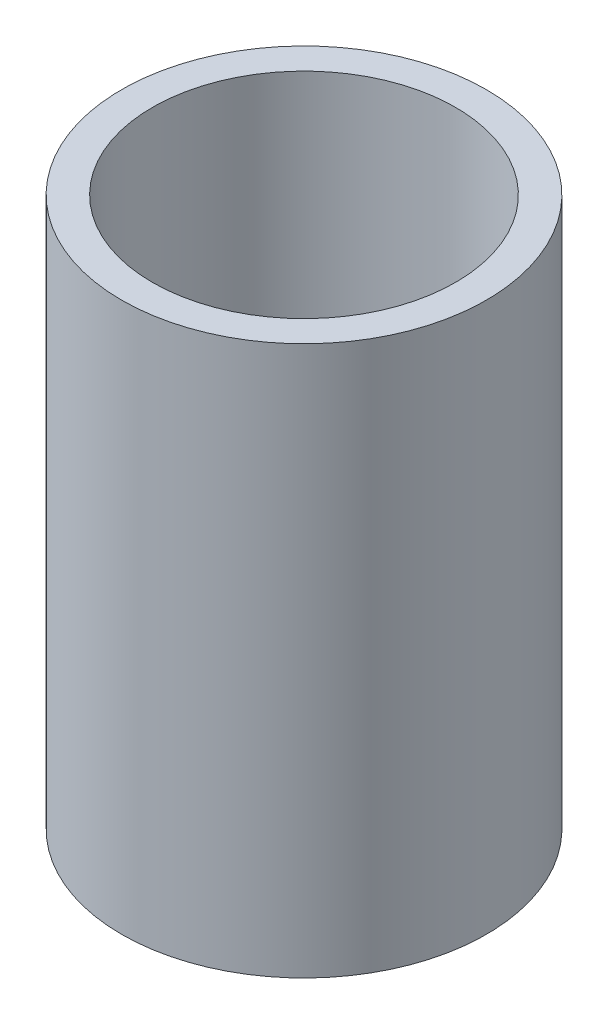
ISO-10303-21;
HEADER;
FILE_DESCRIPTION(('STEP AP214'),'2;1');
FILE_NAME('part.step','',(''),(''),'','','');
FILE_SCHEMA(('AUTOMOTIVE_DESIGN { 1 0 10303 214 1 1 1 1 }'));
ENDSEC;
DATA;
#1=APPLICATION_CONTEXT('core data for automotive mechanical design processes');
#2=APPLICATION_PROTOCOL_DEFINITION('international standard','automotive_design',2000,#1);
#3=PRODUCT_CONTEXT('',#1,'mechanical');
#4=PRODUCT('Part','Part','',(#3));
#5=PRODUCT_RELATED_PRODUCT_CATEGORY('part','',(#4));
#6=PRODUCT_DEFINITION_FORMATION('','',#4);
#7=PRODUCT_DEFINITION_CONTEXT('part definition',#1,'design');
#8=PRODUCT_DEFINITION('design','',#6,#7);
#9=PRODUCT_DEFINITION_SHAPE('','',#8);
#10=(LENGTH_UNIT() NAMED_UNIT(*) SI_UNIT(.MILLI.,.METRE.));
#11=(NAMED_UNIT(*) PLANE_ANGLE_UNIT() SI_UNIT($,.RADIAN.));
#12=(NAMED_UNIT(*) SI_UNIT($,.STERADIAN.) SOLID_ANGLE_UNIT());
#13=UNCERTAINTY_MEASURE_WITH_UNIT(LENGTH_MEASURE(1.E-05),#10,'distance_accuracy_value','');
#14=(GEOMETRIC_REPRESENTATION_CONTEXT(3) GLOBAL_UNCERTAINTY_ASSIGNED_CONTEXT((#13)) GLOBAL_UNIT_ASSIGNED_CONTEXT((#10,
#11,#12)) REPRESENTATION_CONTEXT('',''));
#15=CARTESIAN_POINT('',(0.,0.,0.));
#16=DIRECTION('',(0.,0.,1.));
#17=DIRECTION('',(1.,0.,0.));
#18=AXIS2_PLACEMENT_3D('',#15,#16,#17);
#19=CARTESIAN_POINT('',(0.,63.5,0.));
#20=DIRECTION('',(0.,1.,0.));
#21=DIRECTION('',(0.,0.,1.));
#22=AXIS2_PLACEMENT_3D('',#19,#20,#21);
#23=PLANE('',#22);
#24=CARTESIAN_POINT('',(0.,63.5,0.));
#25=DIRECTION('',(0.,1.,0.));
#26=DIRECTION('',(0.,0.,1.));
#27=AXIS2_PLACEMENT_3D('',#24,#25,#26);
#28=CIRCLE('',#27,21.082);
#29=CARTESIAN_POINT('',(0.,63.5,21.082));
#30=VERTEX_POINT('',#29);
#31=EDGE_CURVE('E10',#30,#30,#28,.T.);
#32=ORIENTED_EDGE('',*,*,#31,.T.);
#33=EDGE_LOOP('',(#32));
#34=FACE_BOUND('',#33,.T.);
#35=CARTESIAN_POINT('',(0.,63.5,0.));
#36=DIRECTION('',(0.,1.,0.));
#37=DIRECTION('',(0.,0.,1.));
#38=AXIS2_PLACEMENT_3D('',#35,#36,#37);
#39=CIRCLE('',#38,17.526);
#40=CARTESIAN_POINT('',(0.,63.5,17.526));
#41=VERTEX_POINT('',#40);
#42=EDGE_CURVE('E41',#41,#41,#39,.T.);
#43=ORIENTED_EDGE('',*,*,#42,.F.);
#44=EDGE_LOOP('',(#43));
#45=FACE_BOUND('',#44,.T.);
#46=ADVANCED_FACE('F30',(#34,#45),#23,.T.);
#47=CARTESIAN_POINT('',(0.,0.,0.));
#48=DIRECTION('',(0.,1.,0.));
#49=DIRECTION('',(0.,0.,1.));
#50=AXIS2_PLACEMENT_3D('',#47,#48,#49);
#51=PLANE('',#50);
#52=CARTESIAN_POINT('',(0.,0.,0.));
#53=DIRECTION('',(0.,1.,0.));
#54=DIRECTION('',(0.,0.,1.));
#55=AXIS2_PLACEMENT_3D('',#52,#53,#54);
#56=CIRCLE('',#55,21.082);
#57=CARTESIAN_POINT('',(0.,0.,21.082));
#58=VERTEX_POINT('',#57);
#59=EDGE_CURVE('E34',#58,#58,#56,.T.);
#60=ORIENTED_EDGE('',*,*,#59,.F.);
#61=EDGE_LOOP('',(#60));
#62=FACE_BOUND('',#61,.T.);
#63=CARTESIAN_POINT('',(0.,0.,0.));
#64=DIRECTION('',(0.,1.,0.));
#65=DIRECTION('',(0.,0.,1.));
#66=AXIS2_PLACEMENT_3D('',#63,#64,#65);
#67=CIRCLE('',#66,17.526);
#68=CARTESIAN_POINT('',(0.,0.,17.526));
#69=VERTEX_POINT('',#68);
#70=EDGE_CURVE('E43',#69,#69,#67,.T.);
#71=ORIENTED_EDGE('',*,*,#70,.T.);
#72=EDGE_LOOP('',(#71));
#73=FACE_BOUND('',#72,.T.);
#74=ADVANCED_FACE('F53',(#62,#73),#51,.F.);
#75=CARTESIAN_POINT('',(0.,63.5,0.));
#76=DIRECTION('',(0.,-1.,0.));
#77=DIRECTION('',(0.,0.,-1.));
#78=AXIS2_PLACEMENT_3D('',#75,#76,#77);
#79=CYLINDRICAL_SURFACE('',#78,21.082);
#80=ORIENTED_EDGE('',*,*,#31,.F.);
#81=EDGE_LOOP('',(#80));
#82=FACE_BOUND('',#81,.T.);
#83=ORIENTED_EDGE('',*,*,#59,.T.);
#84=EDGE_LOOP('',(#83));
#85=FACE_BOUND('',#84,.T.);
#86=ADVANCED_FACE('F32',(#82,#85),#79,.T.);
#87=CARTESIAN_POINT('',(0.,63.5,0.));
#88=DIRECTION('',(0.,-1.,0.));
#89=DIRECTION('',(0.,0.,-1.));
#90=AXIS2_PLACEMENT_3D('',#87,#88,#89);
#91=CYLINDRICAL_SURFACE('',#90,17.526);
#92=ORIENTED_EDGE('',*,*,#42,.T.);
#93=EDGE_LOOP('',(#92));
#94=FACE_BOUND('',#93,.T.);
#95=ORIENTED_EDGE('',*,*,#70,.F.);
#96=EDGE_LOOP('',(#95));
#97=FACE_BOUND('',#96,.T.);
#98=ADVANCED_FACE('F49',(#94,#97),#91,.F.);
#99=CLOSED_SHELL('',(#46,#74,#86,#98));
#100=MANIFOLD_SOLID_BREP('B2',#99);
#101=ADVANCED_BREP_SHAPE_REPRESENTATION('',(#18,#100),#14);
#102=SHAPE_DEFINITION_REPRESENTATION(#9,#101);
ENDSEC;
END-ISO-10303-21;
